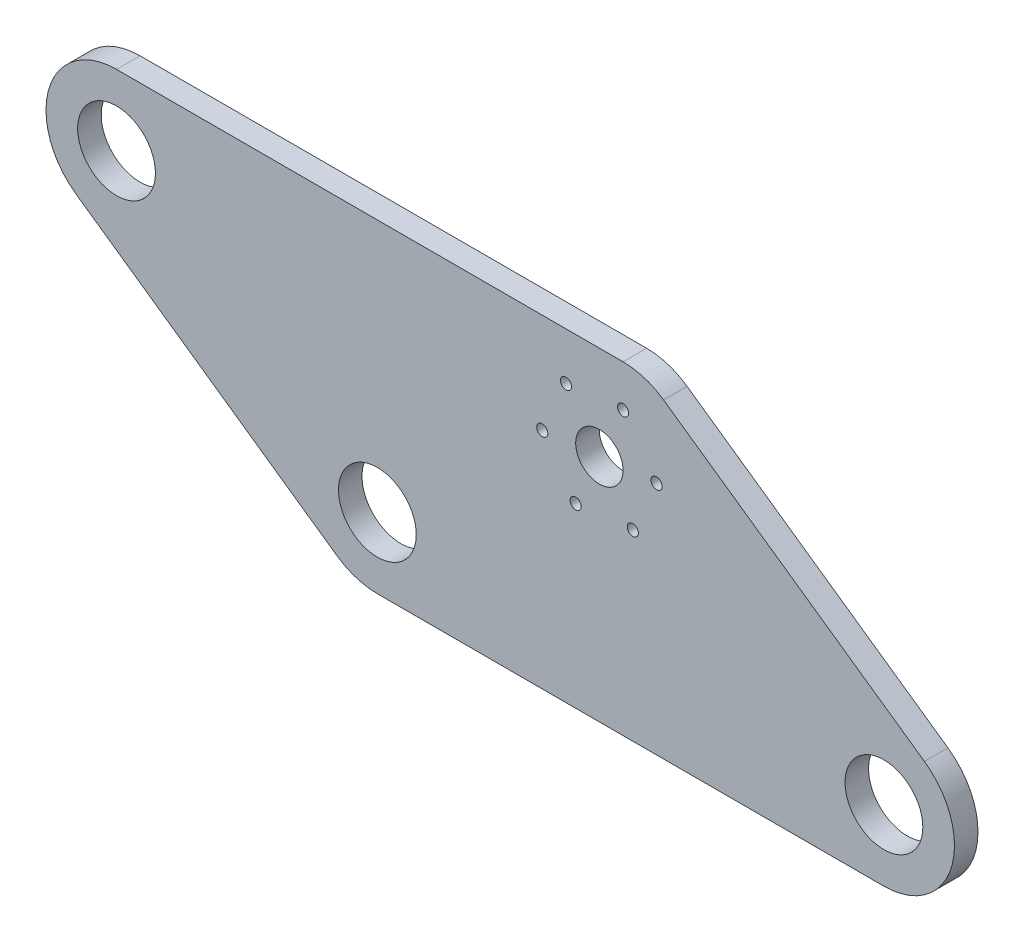
ISO-10303-21;
HEADER;
FILE_DESCRIPTION(('STEP AP214'),'2;1');
FILE_NAME('part.step','',(''),(''),'','','');
FILE_SCHEMA(('AUTOMOTIVE_DESIGN { 1 0 10303 214 1 1 1 1 }'));
ENDSEC;
DATA;
#1=APPLICATION_CONTEXT('core data for automotive mechanical design processes');
#2=APPLICATION_PROTOCOL_DEFINITION('international standard','automotive_design',2000,#1);
#3=PRODUCT_CONTEXT('',#1,'mechanical');
#4=PRODUCT('Part','Part','',(#3));
#5=PRODUCT_RELATED_PRODUCT_CATEGORY('part','',(#4));
#6=PRODUCT_DEFINITION_FORMATION('','',#4);
#7=PRODUCT_DEFINITION_CONTEXT('part definition',#1,'design');
#8=PRODUCT_DEFINITION('design','',#6,#7);
#9=PRODUCT_DEFINITION_SHAPE('','',#8);
#10=(LENGTH_UNIT() NAMED_UNIT(*) SI_UNIT(.MILLI.,.METRE.));
#11=(NAMED_UNIT(*) PLANE_ANGLE_UNIT() SI_UNIT($,.RADIAN.));
#12=(NAMED_UNIT(*) SI_UNIT($,.STERADIAN.) SOLID_ANGLE_UNIT());
#13=UNCERTAINTY_MEASURE_WITH_UNIT(LENGTH_MEASURE(1.E-05),#10,'distance_accuracy_value','');
#14=(GEOMETRIC_REPRESENTATION_CONTEXT(3) GLOBAL_UNCERTAINTY_ASSIGNED_CONTEXT((#13)) GLOBAL_UNIT_ASSIGNED_CONTEXT((#10,
#11,#12)) REPRESENTATION_CONTEXT('',''));
#15=CARTESIAN_POINT('',(0.,0.,0.));
#16=DIRECTION('',(0.,0.,1.));
#17=DIRECTION('',(1.,0.,0.));
#18=AXIS2_PLACEMENT_3D('',#15,#16,#17);
#19=CARTESIAN_POINT('',(-27.5612284503571,-62.0130488998987,6.35));
#20=DIRECTION('',(0.573576436351041,0.819152044288995,0.));
#21=DIRECTION('',(-0.819152044288995,0.573576436351041,0.));
#22=AXIS2_PLACEMENT_3D('',#19,#20,#21);
#23=PLANE('',#22);
#24=DIRECTION('',(0.819152044288995,-0.573576436351041,0.));
#25=VECTOR('',#24,1.);
#26=CARTESIAN_POINT('',(-27.5612284503571,-62.0130488998987,0.));
#27=LINE('',#26,#25);
#28=CARTESIAN_POINT('',(-102.907750127468,-9.25484644370535,0.));
#29=VERTEX_POINT('',#28);
#30=CARTESIAN_POINT('',(-32.4814176346999,-58.5678953436041,0.));
#31=VERTEX_POINT('',#30);
#32=EDGE_CURVE('E165',#29,#31,#27,.T.);
#33=ORIENTED_EDGE('',*,*,#32,.T.);
#34=DIRECTION('',(0.,0.,-1.));
#35=VECTOR('',#34,1.);
#36=CARTESIAN_POINT('',(-32.4814176346999,-58.5678953436041,6.35));
#37=LINE('',#36,#35);
#38=CARTESIAN_POINT('',(-32.4814176346999,-58.5678953436041,6.35));
#39=VERTEX_POINT('',#38);
#40=EDGE_CURVE('E11',#31,#39,#37,.F.);
#41=ORIENTED_EDGE('',*,*,#40,.T.);
#42=DIRECTION('',(0.819152044288995,-0.573576436351041,0.));
#43=VECTOR('',#42,1.);
#44=CARTESIAN_POINT('',(-27.5612284503571,-62.0130488998987,6.35));
#45=LINE('',#44,#43);
#46=CARTESIAN_POINT('',(-102.907750127468,-9.25484644370535,6.35));
#47=VERTEX_POINT('',#46);
#48=EDGE_CURVE('E133',#47,#39,#45,.T.);
#49=ORIENTED_EDGE('',*,*,#48,.F.);
#50=DIRECTION('',(0.,0.,-1.));
#51=VECTOR('',#50,1.);
#52=CARTESIAN_POINT('',(-102.907750127468,-9.25484644370535,6.35));
#53=LINE('',#52,#51);
#54=EDGE_CURVE('E49',#47,#29,#53,.T.);
#55=ORIENTED_EDGE('',*,*,#54,.T.);
#56=EDGE_LOOP('',(#33,#41,#49,#55));
#57=FACE_BOUND('',#56,.T.);
#58=ADVANCED_FACE('F41',(#57),#23,.F.);
#59=CARTESIAN_POINT('',(175.638771549643,-62.0130488998987,6.35));
#60=DIRECTION('',(0.,1.,0.));
#61=DIRECTION('',(-1.,0.,0.));
#62=AXIS2_PLACEMENT_3D('',#59,#60,#61);
#63=PLANE('',#62);
#64=DIRECTION('',(1.,0.,0.));
#65=VECTOR('',#64,1.);
#66=CARTESIAN_POINT('',(175.638771549643,-62.0130488998987,6.35));
#67=LINE('',#66,#65);
#68=CARTESIAN_POINT('',(-21.5547865222126,-62.0130488998987,6.35));
#69=VERTEX_POINT('',#68);
#70=CARTESIAN_POINT('',(115.219890564623,-62.0130488998987,6.35));
#71=VERTEX_POINT('',#70);
#72=EDGE_CURVE('E136',#69,#71,#67,.T.);
#73=ORIENTED_EDGE('',*,*,#72,.F.);
#74=DIRECTION('',(0.,0.,-1.));
#75=VECTOR('',#74,1.);
#76=CARTESIAN_POINT('',(-21.5547865222126,-62.0130488998987,6.35));
#77=LINE('',#76,#75);
#78=CARTESIAN_POINT('',(-21.5547865222126,-62.0130488998987,0.));
#79=VERTEX_POINT('',#78);
#80=EDGE_CURVE('E158',#69,#79,#77,.T.);
#81=ORIENTED_EDGE('',*,*,#80,.T.);
#82=DIRECTION('',(1.,0.,0.));
#83=VECTOR('',#82,1.);
#84=CARTESIAN_POINT('',(175.638771549643,-62.0130488998987,0.));
#85=LINE('',#84,#83);
#86=CARTESIAN_POINT('',(115.219890564623,-62.0130488998987,0.));
#87=VERTEX_POINT('',#86);
#88=EDGE_CURVE('E138',#79,#87,#85,.T.);
#89=ORIENTED_EDGE('',*,*,#88,.T.);
#90=DIRECTION('',(0.,0.,-1.));
#91=VECTOR('',#90,1.);
#92=CARTESIAN_POINT('',(115.219890564623,-62.0130488998987,6.35));
#93=LINE('',#92,#91);
#94=EDGE_CURVE('E56',#87,#71,#93,.F.);
#95=ORIENTED_EDGE('',*,*,#94,.T.);
#96=EDGE_LOOP('',(#73,#81,#89,#95));
#97=FACE_BOUND('',#96,.T.);
#98=ADVANCED_FACE('F268',(#97),#63,.F.);
#99=CARTESIAN_POINT('',(50.8,25.4,6.35));
#100=DIRECTION('',(-0.573576436351041,-0.819152044288995,0.));
#101=DIRECTION('',(0.819152044288995,-0.573576436351041,0.));
#102=AXIS2_PLACEMENT_3D('',#99,#100,#101);
#103=PLANE('',#102);
#104=DIRECTION('',(-0.819152044288995,0.573576436351041,0.));
#105=VECTOR('',#104,1.);
#106=CARTESIAN_POINT('',(50.8,25.4,0.));
#107=LINE('',#106,#105);
#108=CARTESIAN_POINT('',(126.14652167711,-27.3582024561934,0.));
#109=VERTEX_POINT('',#108);
#110=CARTESIAN_POINT('',(55.7201891843428,21.9548464437054,0.));
#111=VERTEX_POINT('',#110);
#112=EDGE_CURVE('E134',#109,#111,#107,.T.);
#113=ORIENTED_EDGE('',*,*,#112,.T.);
#114=DIRECTION('',(0.,0.,-1.));
#115=VECTOR('',#114,1.);
#116=CARTESIAN_POINT('',(55.7201891843428,21.9548464437054,6.35));
#117=LINE('',#116,#115);
#118=CARTESIAN_POINT('',(55.7201891843428,21.9548464437054,6.35));
#119=VERTEX_POINT('',#118);
#120=EDGE_CURVE('E112',#111,#119,#117,.F.);
#121=ORIENTED_EDGE('',*,*,#120,.T.);
#122=DIRECTION('',(-0.819152044288995,0.573576436351041,0.));
#123=VECTOR('',#122,1.);
#124=CARTESIAN_POINT('',(50.8,25.4,6.35));
#125=LINE('',#124,#123);
#126=CARTESIAN_POINT('',(126.14652167711,-27.3582024561934,6.35));
#127=VERTEX_POINT('',#126);
#128=EDGE_CURVE('E177',#127,#119,#125,.T.);
#129=ORIENTED_EDGE('',*,*,#128,.F.);
#130=DIRECTION('',(0.,0.,-1.));
#131=VECTOR('',#130,1.);
#132=CARTESIAN_POINT('',(126.14652167711,-27.3582024561934,6.35));
#133=LINE('',#132,#131);
#134=EDGE_CURVE('E117',#127,#109,#133,.T.);
#135=ORIENTED_EDGE('',*,*,#134,.T.);
#136=EDGE_LOOP('',(#113,#121,#129,#135));
#137=FACE_BOUND('',#136,.T.);
#138=ADVANCED_FACE('F265',(#137),#103,.F.);
#139=CARTESIAN_POINT('',(-152.4,25.4,6.35));
#140=DIRECTION('',(0.,-1.,0.));
#141=DIRECTION('',(0.,0.,-1.));
#142=AXIS2_PLACEMENT_3D('',#139,#140,#141);
#143=PLANE('',#142);
#144=DIRECTION('',(-1.,0.,0.));
#145=VECTOR('',#144,1.);
#146=CARTESIAN_POINT('',(-152.4,25.4,6.35));
#147=LINE('',#146,#145);
#148=CARTESIAN_POINT('',(44.7935580718554,25.4,6.35));
#149=VERTEX_POINT('',#148);
#150=CARTESIAN_POINT('',(-91.9811190149802,25.4,6.35));
#151=VERTEX_POINT('',#150);
#152=EDGE_CURVE('E127',#149,#151,#147,.T.);
#153=ORIENTED_EDGE('',*,*,#152,.F.);
#154=DIRECTION('',(0.,0.,-1.));
#155=VECTOR('',#154,1.);
#156=CARTESIAN_POINT('',(44.7935580718554,25.4,6.35));
#157=LINE('',#156,#155);
#158=CARTESIAN_POINT('',(44.7935580718554,25.4,0.));
#159=VERTEX_POINT('',#158);
#160=EDGE_CURVE('E111',#149,#159,#157,.T.);
#161=ORIENTED_EDGE('',*,*,#160,.T.);
#162=DIRECTION('',(-1.,0.,0.));
#163=VECTOR('',#162,1.);
#164=CARTESIAN_POINT('',(-152.4,25.4,0.));
#165=LINE('',#164,#163);
#166=CARTESIAN_POINT('',(-91.9811190149802,25.4,0.));
#167=VERTEX_POINT('',#166);
#168=EDGE_CURVE('E124',#159,#167,#165,.T.);
#169=ORIENTED_EDGE('',*,*,#168,.T.);
#170=DIRECTION('',(0.,0.,-1.));
#171=VECTOR('',#170,1.);
#172=CARTESIAN_POINT('',(-91.9811190149802,25.4,6.35));
#173=LINE('',#172,#171);
#174=EDGE_CURVE('E129',#167,#151,#173,.F.);
#175=ORIENTED_EDGE('',*,*,#174,.T.);
#176=EDGE_LOOP('',(#153,#161,#169,#175));
#177=FACE_BOUND('',#176,.T.);
#178=ADVANCED_FACE('F123',(#177),#143,.F.);
#179=CARTESIAN_POINT('',(0.,0.,6.35));
#180=DIRECTION('',(0.,0.,-1.));
#181=DIRECTION('',(-1.,0.,0.));
#182=AXIS2_PLACEMENT_3D('',#179,#180,#181);
#183=PLANE('',#182);
#184=CARTESIAN_POINT('',(-91.9811190149802,6.35,6.35));
#185=DIRECTION('',(0.,0.,1.));
#186=DIRECTION('',(1.,0.,0.));
#187=AXIS2_PLACEMENT_3D('',#184,#185,#186);
#188=CIRCLE('',#187,10.5);
#189=CARTESIAN_POINT('',(-81.4811190149802,6.35,6.35));
#190=VERTEX_POINT('',#189);
#191=EDGE_CURVE('E173',#190,#190,#188,.T.);
#192=ORIENTED_EDGE('',*,*,#191,.F.);
#193=EDGE_LOOP('',(#192));
#194=FACE_BOUND('',#193,.T.);
#195=CARTESIAN_POINT('',(29.367867907288,12.6010680917624,6.35));
#196=DIRECTION('',(0.,0.,1.));
#197=DIRECTION('',(1.,0.,0.));
#198=AXIS2_PLACEMENT_3D('',#195,#196,#197);
#199=CIRCLE('',#198,1.50000000000001);
#200=CARTESIAN_POINT('',(30.867867907288,12.6010680917624,6.35));
#201=VERTEX_POINT('',#200);
#202=EDGE_CURVE('E210',#201,#201,#199,.T.);
#203=ORIENTED_EDGE('',*,*,#202,.F.);
#204=EDGE_LOOP('',(#203));
#205=FACE_BOUND('',#204,.T.);
#206=CARTESIAN_POINT('',(44.7935580718554,14.1170110150839,6.35));
#207=DIRECTION('',(0.,0.,1.));
#208=DIRECTION('',(1.,0.,0.));
#209=AXIS2_PLACEMENT_3D('',#206,#207,#208);
#210=CIRCLE('',#209,1.5);
#211=CARTESIAN_POINT('',(46.2935580718554,14.1170110150839,6.35));
#212=VERTEX_POINT('',#211);
#213=EDGE_CURVE('E197',#212,#212,#210,.T.);
#214=ORIENTED_EDGE('',*,*,#213,.F.);
#215=EDGE_LOOP('',(#214));
#216=FACE_BOUND('',#215,.T.);
#217=CARTESIAN_POINT('',(115.219890564623,-42.9630488998987,6.35));
#218=DIRECTION('',(0.,0.,1.));
#219=DIRECTION('',(1.,0.,0.));
#220=AXIS2_PLACEMENT_3D('',#217,#218,#219);
#221=CIRCLE('',#220,10.5);
#222=CARTESIAN_POINT('',(125.719890564623,-42.9630488998987,6.35));
#223=VERTEX_POINT('',#222);
#224=EDGE_CURVE('E185',#223,#223,#221,.T.);
#225=ORIENTED_EDGE('',*,*,#224,.F.);
#226=EDGE_LOOP('',(#225));
#227=FACE_BOUND('',#226,.T.);
#228=CARTESIAN_POINT('',(-21.5547865222126,-42.9630488998987,6.35));
#229=DIRECTION('',(0.,0.,1.));
#230=DIRECTION('',(1.,0.,0.));
#231=AXIS2_PLACEMENT_3D('',#228,#229,#230);
#232=CIRCLE('',#231,10.5);
#233=CARTESIAN_POINT('',(-11.0547865222126,-42.9630488998987,6.35));
#234=VERTEX_POINT('',#233);
#235=EDGE_CURVE('E184',#234,#234,#232,.T.);
#236=ORIENTED_EDGE('',*,*,#235,.F.);
#237=EDGE_LOOP('',(#236));
#238=FACE_BOUND('',#237,.T.);
#239=CARTESIAN_POINT('',(38.3935580718554,0.,6.35));
#240=DIRECTION('',(0.,0.,1.));
#241=DIRECTION('',(1.,0.,0.));
#242=AXIS2_PLACEMENT_3D('',#239,#240,#241);
#243=CIRCLE('',#242,6.40000000000001);
#244=CARTESIAN_POINT('',(44.7935580718554,0.,6.35));
#245=VERTEX_POINT('',#244);
#246=EDGE_CURVE('E191',#245,#245,#243,.T.);
#247=ORIENTED_EDGE('',*,*,#246,.F.);
#248=EDGE_LOOP('',(#247));
#249=FACE_BOUND('',#248,.T.);
#250=CARTESIAN_POINT('',(53.8192482364228,1.51594292332154,6.35));
#251=DIRECTION('',(0.,0.,1.));
#252=DIRECTION('',(1.,0.,0.));
#253=AXIS2_PLACEMENT_3D('',#250,#251,#252);
#254=CIRCLE('',#253,1.5);
#255=CARTESIAN_POINT('',(55.3192482364228,1.51594292332154,6.35));
#256=VERTEX_POINT('',#255);
#257=EDGE_CURVE('E198',#256,#256,#254,.T.);
#258=ORIENTED_EDGE('',*,*,#257,.F.);
#259=EDGE_LOOP('',(#258));
#260=FACE_BOUND('',#259,.T.);
#261=CARTESIAN_POINT('',(47.4192482364228,-12.6010680917623,6.35));
#262=DIRECTION('',(0.,0.,1.));
#263=DIRECTION('',(1.,0.,0.));
#264=AXIS2_PLACEMENT_3D('',#261,#262,#263);
#265=CIRCLE('',#264,1.50000000000001);
#266=CARTESIAN_POINT('',(48.9192482364228,-12.6010680917623,6.35));
#267=VERTEX_POINT('',#266);
#268=EDGE_CURVE('E222',#267,#267,#265,.T.);
#269=ORIENTED_EDGE('',*,*,#268,.F.);
#270=EDGE_LOOP('',(#269));
#271=FACE_BOUND('',#270,.T.);
#272=CARTESIAN_POINT('',(31.9935580718554,-14.1170110150839,6.35));
#273=DIRECTION('',(0.,0.,1.));
#274=DIRECTION('',(1.,0.,0.));
#275=AXIS2_PLACEMENT_3D('',#272,#273,#274);
#276=CIRCLE('',#275,1.5);
#277=CARTESIAN_POINT('',(33.4935580718554,-14.1170110150839,6.35));
#278=VERTEX_POINT('',#277);
#279=EDGE_CURVE('E216',#278,#278,#276,.T.);
#280=ORIENTED_EDGE('',*,*,#279,.F.);
#281=EDGE_LOOP('',(#280));
#282=FACE_BOUND('',#281,.T.);
#283=CARTESIAN_POINT('',(22.967867907288,-1.51594292332154,6.35));
#284=DIRECTION('',(0.,0.,1.));
#285=DIRECTION('',(1.,0.,0.));
#286=AXIS2_PLACEMENT_3D('',#283,#284,#285);
#287=CIRCLE('',#286,1.5);
#288=CARTESIAN_POINT('',(24.467867907288,-1.51594292332154,6.35));
#289=VERTEX_POINT('',#288);
#290=EDGE_CURVE('E209',#289,#289,#287,.T.);
#291=ORIENTED_EDGE('',*,*,#290,.F.);
#292=EDGE_LOOP('',(#291));
#293=FACE_BOUND('',#292,.T.);
#294=ORIENTED_EDGE('',*,*,#128,.T.);
#295=CARTESIAN_POINT('',(44.7935580718554,6.35,6.35));
#296=DIRECTION('',(0.,0.,-1.));
#297=DIRECTION('',(-1.,0.,0.));
#298=AXIS2_PLACEMENT_3D('',#295,#296,#297);
#299=CIRCLE('',#298,19.05);
#300=EDGE_CURVE('E155',#119,#149,#299,.F.);
#301=ORIENTED_EDGE('',*,*,#300,.T.);
#302=ORIENTED_EDGE('',*,*,#152,.T.);
#303=CARTESIAN_POINT('',(-91.9811190149802,6.35,6.35));
#304=DIRECTION('',(0.,0.,-1.));
#305=DIRECTION('',(-1.,0.,0.));
#306=AXIS2_PLACEMENT_3D('',#303,#304,#305);
#307=CIRCLE('',#306,19.05);
#308=EDGE_CURVE('E150',#151,#47,#307,.F.);
#309=ORIENTED_EDGE('',*,*,#308,.T.);
#310=ORIENTED_EDGE('',*,*,#48,.T.);
#311=CARTESIAN_POINT('',(-21.5547865222126,-42.9630488998987,6.35));
#312=DIRECTION('',(0.,0.,-1.));
#313=DIRECTION('',(-1.,0.,0.));
#314=AXIS2_PLACEMENT_3D('',#311,#312,#313);
#315=CIRCLE('',#314,19.05);
#316=EDGE_CURVE('E63',#39,#69,#315,.F.);
#317=ORIENTED_EDGE('',*,*,#316,.T.);
#318=ORIENTED_EDGE('',*,*,#72,.T.);
#319=CARTESIAN_POINT('',(115.219890564623,-42.9630488998987,6.35));
#320=DIRECTION('',(0.,0.,-1.));
#321=DIRECTION('',(-1.,0.,0.));
#322=AXIS2_PLACEMENT_3D('',#319,#320,#321);
#323=CIRCLE('',#322,19.05);
#324=EDGE_CURVE('E152',#71,#127,#323,.F.);
#325=ORIENTED_EDGE('',*,*,#324,.T.);
#326=EDGE_LOOP('',(#294,#301,#302,#309,#310,#317,#318,#325));
#327=FACE_BOUND('',#326,.T.);
#328=ADVANCED_FACE('F240',(#194,#205,#216,#227,#238,#249,#260,#271,#282,#293,#327),#183,.F.);
#329=CARTESIAN_POINT('',(0.,0.,0.));
#330=DIRECTION('',(0.,0.,-1.));
#331=DIRECTION('',(-1.,0.,0.));
#332=AXIS2_PLACEMENT_3D('',#329,#330,#331);
#333=PLANE('',#332);
#334=CARTESIAN_POINT('',(-91.9811190149802,6.35,0.));
#335=DIRECTION('',(0.,0.,1.));
#336=DIRECTION('',(1.,0.,0.));
#337=AXIS2_PLACEMENT_3D('',#334,#335,#336);
#338=CIRCLE('',#337,10.5);
#339=CARTESIAN_POINT('',(-81.4811190149802,6.35,0.));
#340=VERTEX_POINT('',#339);
#341=EDGE_CURVE('E170',#340,#340,#338,.T.);
#342=ORIENTED_EDGE('',*,*,#341,.T.);
#343=EDGE_LOOP('',(#342));
#344=FACE_BOUND('',#343,.T.);
#345=CARTESIAN_POINT('',(29.367867907288,12.6010680917624,0.));
#346=DIRECTION('',(0.,0.,1.));
#347=DIRECTION('',(1.,0.,0.));
#348=AXIS2_PLACEMENT_3D('',#345,#346,#347);
#349=CIRCLE('',#348,1.50000000000001);
#350=CARTESIAN_POINT('',(30.867867907288,12.6010680917624,0.));
#351=VERTEX_POINT('',#350);
#352=EDGE_CURVE('E230',#351,#351,#349,.T.);
#353=ORIENTED_EDGE('',*,*,#352,.T.);
#354=EDGE_LOOP('',(#353));
#355=FACE_BOUND('',#354,.T.);
#356=CARTESIAN_POINT('',(44.7935580718554,14.1170110150839,0.));
#357=DIRECTION('',(0.,0.,1.));
#358=DIRECTION('',(1.,0.,0.));
#359=AXIS2_PLACEMENT_3D('',#356,#357,#358);
#360=CIRCLE('',#359,1.5);
#361=CARTESIAN_POINT('',(46.2935580718554,14.1170110150839,0.));
#362=VERTEX_POINT('',#361);
#363=EDGE_CURVE('E194',#362,#362,#360,.T.);
#364=ORIENTED_EDGE('',*,*,#363,.T.);
#365=EDGE_LOOP('',(#364));
#366=FACE_BOUND('',#365,.T.);
#367=CARTESIAN_POINT('',(115.219890564623,-42.9630488998987,0.));
#368=DIRECTION('',(0.,0.,1.));
#369=DIRECTION('',(1.,0.,0.));
#370=AXIS2_PLACEMENT_3D('',#367,#368,#369);
#371=CIRCLE('',#370,10.5);
#372=CARTESIAN_POINT('',(125.719890564623,-42.9630488998987,0.));
#373=VERTEX_POINT('',#372);
#374=EDGE_CURVE('E201',#373,#373,#371,.T.);
#375=ORIENTED_EDGE('',*,*,#374,.T.);
#376=EDGE_LOOP('',(#375));
#377=FACE_BOUND('',#376,.T.);
#378=CARTESIAN_POINT('',(-21.5547865222126,-42.9630488998987,0.));
#379=DIRECTION('',(0.,0.,1.));
#380=DIRECTION('',(1.,0.,0.));
#381=AXIS2_PLACEMENT_3D('',#378,#379,#380);
#382=CIRCLE('',#381,10.5);
#383=CARTESIAN_POINT('',(-11.0547865222126,-42.9630488998987,0.));
#384=VERTEX_POINT('',#383);
#385=EDGE_CURVE('E181',#384,#384,#382,.T.);
#386=ORIENTED_EDGE('',*,*,#385,.T.);
#387=EDGE_LOOP('',(#386));
#388=FACE_BOUND('',#387,.T.);
#389=CARTESIAN_POINT('',(38.3935580718554,0.,0.));
#390=DIRECTION('',(0.,0.,1.));
#391=DIRECTION('',(1.,0.,0.));
#392=AXIS2_PLACEMENT_3D('',#389,#390,#391);
#393=CIRCLE('',#392,6.40000000000001);
#394=CARTESIAN_POINT('',(44.7935580718554,0.,0.));
#395=VERTEX_POINT('',#394);
#396=EDGE_CURVE('E188',#395,#395,#393,.T.);
#397=ORIENTED_EDGE('',*,*,#396,.T.);
#398=EDGE_LOOP('',(#397));
#399=FACE_BOUND('',#398,.T.);
#400=CARTESIAN_POINT('',(53.8192482364228,1.51594292332154,0.));
#401=DIRECTION('',(0.,0.,1.));
#402=DIRECTION('',(1.,0.,0.));
#403=AXIS2_PLACEMENT_3D('',#400,#401,#402);
#404=CIRCLE('',#403,1.5);
#405=CARTESIAN_POINT('',(55.3192482364228,1.51594292332154,0.));
#406=VERTEX_POINT('',#405);
#407=EDGE_CURVE('E225',#406,#406,#404,.T.);
#408=ORIENTED_EDGE('',*,*,#407,.T.);
#409=EDGE_LOOP('',(#408));
#410=FACE_BOUND('',#409,.T.);
#411=CARTESIAN_POINT('',(47.4192482364228,-12.6010680917623,0.));
#412=DIRECTION('',(0.,0.,1.));
#413=DIRECTION('',(1.,0.,0.));
#414=AXIS2_PLACEMENT_3D('',#411,#412,#413);
#415=CIRCLE('',#414,1.50000000000001);
#416=CARTESIAN_POINT('',(48.9192482364228,-12.6010680917623,0.));
#417=VERTEX_POINT('',#416);
#418=EDGE_CURVE('E219',#417,#417,#415,.T.);
#419=ORIENTED_EDGE('',*,*,#418,.T.);
#420=EDGE_LOOP('',(#419));
#421=FACE_BOUND('',#420,.T.);
#422=CARTESIAN_POINT('',(31.9935580718554,-14.1170110150839,0.));
#423=DIRECTION('',(0.,0.,1.));
#424=DIRECTION('',(1.,0.,0.));
#425=AXIS2_PLACEMENT_3D('',#422,#423,#424);
#426=CIRCLE('',#425,1.5);
#427=CARTESIAN_POINT('',(33.4935580718554,-14.1170110150839,0.));
#428=VERTEX_POINT('',#427);
#429=EDGE_CURVE('E213',#428,#428,#426,.T.);
#430=ORIENTED_EDGE('',*,*,#429,.T.);
#431=EDGE_LOOP('',(#430));
#432=FACE_BOUND('',#431,.T.);
#433=CARTESIAN_POINT('',(22.967867907288,-1.51594292332154,0.));
#434=DIRECTION('',(0.,0.,1.));
#435=DIRECTION('',(1.,0.,0.));
#436=AXIS2_PLACEMENT_3D('',#433,#434,#435);
#437=CIRCLE('',#436,1.5);
#438=CARTESIAN_POINT('',(24.467867907288,-1.51594292332154,0.));
#439=VERTEX_POINT('',#438);
#440=EDGE_CURVE('E206',#439,#439,#437,.T.);
#441=ORIENTED_EDGE('',*,*,#440,.T.);
#442=EDGE_LOOP('',(#441));
#443=FACE_BOUND('',#442,.T.);
#444=ORIENTED_EDGE('',*,*,#168,.F.);
#445=CARTESIAN_POINT('',(44.7935580718554,6.35,0.));
#446=DIRECTION('',(0.,0.,-1.));
#447=DIRECTION('',(-1.,0.,0.));
#448=AXIS2_PLACEMENT_3D('',#445,#446,#447);
#449=CIRCLE('',#448,19.05);
#450=EDGE_CURVE('E107',#159,#111,#449,.T.);
#451=ORIENTED_EDGE('',*,*,#450,.T.);
#452=ORIENTED_EDGE('',*,*,#112,.F.);
#453=CARTESIAN_POINT('',(115.219890564623,-42.9630488998987,0.));
#454=DIRECTION('',(0.,0.,-1.));
#455=DIRECTION('',(-1.,0.,0.));
#456=AXIS2_PLACEMENT_3D('',#453,#454,#455);
#457=CIRCLE('',#456,19.05);
#458=EDGE_CURVE('E144',#109,#87,#457,.T.);
#459=ORIENTED_EDGE('',*,*,#458,.T.);
#460=ORIENTED_EDGE('',*,*,#88,.F.);
#461=CARTESIAN_POINT('',(-21.5547865222126,-42.9630488998987,0.));
#462=DIRECTION('',(0.,0.,-1.));
#463=DIRECTION('',(-1.,0.,0.));
#464=AXIS2_PLACEMENT_3D('',#461,#462,#463);
#465=CIRCLE('',#464,19.05);
#466=EDGE_CURVE('E118',#79,#31,#465,.T.);
#467=ORIENTED_EDGE('',*,*,#466,.T.);
#468=ORIENTED_EDGE('',*,*,#32,.F.);
#469=CARTESIAN_POINT('',(-91.9811190149802,6.35,0.));
#470=DIRECTION('',(0.,0.,-1.));
#471=DIRECTION('',(-1.,0.,0.));
#472=AXIS2_PLACEMENT_3D('',#469,#470,#471);
#473=CIRCLE('',#472,19.05);
#474=EDGE_CURVE('E128',#29,#167,#473,.T.);
#475=ORIENTED_EDGE('',*,*,#474,.T.);
#476=EDGE_LOOP('',(#444,#451,#452,#459,#460,#467,#468,#475));
#477=FACE_BOUND('',#476,.T.);
#478=ADVANCED_FACE('F131',(#344,#355,#366,#377,#388,#399,#410,#421,#432,#443,#477),#333,.T.);
#479=CARTESIAN_POINT('',(44.7935580718554,6.35,6.35));
#480=DIRECTION('',(0.,0.,-1.));
#481=DIRECTION('',(-1.,0.,0.));
#482=AXIS2_PLACEMENT_3D('',#479,#480,#481);
#483=CYLINDRICAL_SURFACE('',#482,19.05);
#484=ORIENTED_EDGE('',*,*,#300,.F.);
#485=ORIENTED_EDGE('',*,*,#120,.F.);
#486=ORIENTED_EDGE('',*,*,#450,.F.);
#487=ORIENTED_EDGE('',*,*,#160,.F.);
#488=EDGE_LOOP('',(#484,#485,#486,#487));
#489=FACE_BOUND('',#488,.T.);
#490=ADVANCED_FACE('F110',(#489),#483,.T.);
#491=CARTESIAN_POINT('',(-21.5547865222126,-42.9630488998987,6.35));
#492=DIRECTION('',(0.,0.,-1.));
#493=DIRECTION('',(-1.,0.,0.));
#494=AXIS2_PLACEMENT_3D('',#491,#492,#493);
#495=CYLINDRICAL_SURFACE('',#494,19.05);
#496=ORIENTED_EDGE('',*,*,#316,.F.);
#497=ORIENTED_EDGE('',*,*,#40,.F.);
#498=ORIENTED_EDGE('',*,*,#466,.F.);
#499=ORIENTED_EDGE('',*,*,#80,.F.);
#500=EDGE_LOOP('',(#496,#497,#498,#499));
#501=FACE_BOUND('',#500,.T.);
#502=ADVANCED_FACE('F271',(#501),#495,.T.);
#503=CARTESIAN_POINT('',(115.219890564623,-42.9630488998987,6.35));
#504=DIRECTION('',(0.,0.,-1.));
#505=DIRECTION('',(-1.,0.,0.));
#506=AXIS2_PLACEMENT_3D('',#503,#504,#505);
#507=CYLINDRICAL_SURFACE('',#506,19.05);
#508=ORIENTED_EDGE('',*,*,#324,.F.);
#509=ORIENTED_EDGE('',*,*,#94,.F.);
#510=ORIENTED_EDGE('',*,*,#458,.F.);
#511=ORIENTED_EDGE('',*,*,#134,.F.);
#512=EDGE_LOOP('',(#508,#509,#510,#511));
#513=FACE_BOUND('',#512,.T.);
#514=ADVANCED_FACE('F267',(#513),#507,.T.);
#515=CARTESIAN_POINT('',(-91.9811190149802,6.35,6.35));
#516=DIRECTION('',(0.,0.,-1.));
#517=DIRECTION('',(-1.,0.,0.));
#518=AXIS2_PLACEMENT_3D('',#515,#516,#517);
#519=CYLINDRICAL_SURFACE('',#518,19.05);
#520=ORIENTED_EDGE('',*,*,#308,.F.);
#521=ORIENTED_EDGE('',*,*,#174,.F.);
#522=ORIENTED_EDGE('',*,*,#474,.F.);
#523=ORIENTED_EDGE('',*,*,#54,.F.);
#524=EDGE_LOOP('',(#520,#521,#522,#523));
#525=FACE_BOUND('',#524,.T.);
#526=ADVANCED_FACE('F43',(#525),#519,.T.);
#527=CARTESIAN_POINT('',(22.967867907288,-1.51594292332154,0.));
#528=DIRECTION('',(0.,0.,1.));
#529=DIRECTION('',(1.,0.,0.));
#530=AXIS2_PLACEMENT_3D('',#527,#528,#529);
#531=CYLINDRICAL_SURFACE('',#530,1.5);
#532=ORIENTED_EDGE('',*,*,#440,.F.);
#533=EDGE_LOOP('',(#532));
#534=FACE_BOUND('',#533,.T.);
#535=ORIENTED_EDGE('',*,*,#290,.T.);
#536=EDGE_LOOP('',(#535));
#537=FACE_BOUND('',#536,.T.);
#538=ADVANCED_FACE('F273',(#534,#537),#531,.F.);
#539=CARTESIAN_POINT('',(31.9935580718554,-14.1170110150839,0.));
#540=DIRECTION('',(0.,0.,1.));
#541=DIRECTION('',(1.,0.,0.));
#542=AXIS2_PLACEMENT_3D('',#539,#540,#541);
#543=CYLINDRICAL_SURFACE('',#542,1.5);
#544=ORIENTED_EDGE('',*,*,#429,.F.);
#545=EDGE_LOOP('',(#544));
#546=FACE_BOUND('',#545,.T.);
#547=ORIENTED_EDGE('',*,*,#279,.T.);
#548=EDGE_LOOP('',(#547));
#549=FACE_BOUND('',#548,.T.);
#550=ADVANCED_FACE('F278',(#546,#549),#543,.F.);
#551=CARTESIAN_POINT('',(47.4192482364228,-12.6010680917623,0.));
#552=DIRECTION('',(0.,0.,1.));
#553=DIRECTION('',(1.,0.,0.));
#554=AXIS2_PLACEMENT_3D('',#551,#552,#553);
#555=CYLINDRICAL_SURFACE('',#554,1.50000000000001);
#556=ORIENTED_EDGE('',*,*,#418,.F.);
#557=EDGE_LOOP('',(#556));
#558=FACE_BOUND('',#557,.T.);
#559=ORIENTED_EDGE('',*,*,#268,.T.);
#560=EDGE_LOOP('',(#559));
#561=FACE_BOUND('',#560,.T.);
#562=ADVANCED_FACE('F323',(#558,#561),#555,.F.);
#563=CARTESIAN_POINT('',(53.8192482364228,1.51594292332154,0.));
#564=DIRECTION('',(0.,0.,1.));
#565=DIRECTION('',(1.,0.,0.));
#566=AXIS2_PLACEMENT_3D('',#563,#564,#565);
#567=CYLINDRICAL_SURFACE('',#566,1.5);
#568=ORIENTED_EDGE('',*,*,#407,.F.);
#569=EDGE_LOOP('',(#568));
#570=FACE_BOUND('',#569,.T.);
#571=ORIENTED_EDGE('',*,*,#257,.T.);
#572=EDGE_LOOP('',(#571));
#573=FACE_BOUND('',#572,.T.);
#574=ADVANCED_FACE('F333',(#570,#573),#567,.F.);
#575=CARTESIAN_POINT('',(38.3935580718554,0.,0.));
#576=DIRECTION('',(0.,0.,1.));
#577=DIRECTION('',(1.,0.,0.));
#578=AXIS2_PLACEMENT_3D('',#575,#576,#577);
#579=CYLINDRICAL_SURFACE('',#578,6.40000000000001);
#580=ORIENTED_EDGE('',*,*,#396,.F.);
#581=EDGE_LOOP('',(#580));
#582=FACE_BOUND('',#581,.T.);
#583=ORIENTED_EDGE('',*,*,#246,.T.);
#584=EDGE_LOOP('',(#583));
#585=FACE_BOUND('',#584,.T.);
#586=ADVANCED_FACE('F343',(#582,#585),#579,.F.);
#587=CARTESIAN_POINT('',(-21.5547865222126,-42.9630488998987,0.));
#588=DIRECTION('',(0.,0.,1.));
#589=DIRECTION('',(1.,0.,0.));
#590=AXIS2_PLACEMENT_3D('',#587,#588,#589);
#591=CYLINDRICAL_SURFACE('',#590,10.5);
#592=ORIENTED_EDGE('',*,*,#385,.F.);
#593=EDGE_LOOP('',(#592));
#594=FACE_BOUND('',#593,.T.);
#595=ORIENTED_EDGE('',*,*,#235,.T.);
#596=EDGE_LOOP('',(#595));
#597=FACE_BOUND('',#596,.T.);
#598=ADVANCED_FACE('F353',(#594,#597),#591,.F.);
#599=CARTESIAN_POINT('',(115.219890564623,-42.9630488998987,0.));
#600=DIRECTION('',(0.,0.,1.));
#601=DIRECTION('',(1.,0.,0.));
#602=AXIS2_PLACEMENT_3D('',#599,#600,#601);
#603=CYLINDRICAL_SURFACE('',#602,10.5);
#604=ORIENTED_EDGE('',*,*,#374,.F.);
#605=EDGE_LOOP('',(#604));
#606=FACE_BOUND('',#605,.T.);
#607=ORIENTED_EDGE('',*,*,#224,.T.);
#608=EDGE_LOOP('',(#607));
#609=FACE_BOUND('',#608,.T.);
#610=ADVANCED_FACE('F363',(#606,#609),#603,.F.);
#611=CARTESIAN_POINT('',(44.7935580718554,14.1170110150839,0.));
#612=DIRECTION('',(0.,0.,1.));
#613=DIRECTION('',(1.,0.,0.));
#614=AXIS2_PLACEMENT_3D('',#611,#612,#613);
#615=CYLINDRICAL_SURFACE('',#614,1.5);
#616=ORIENTED_EDGE('',*,*,#363,.F.);
#617=EDGE_LOOP('',(#616));
#618=FACE_BOUND('',#617,.T.);
#619=ORIENTED_EDGE('',*,*,#213,.T.);
#620=EDGE_LOOP('',(#619));
#621=FACE_BOUND('',#620,.T.);
#622=ADVANCED_FACE('F373',(#618,#621),#615,.F.);
#623=CARTESIAN_POINT('',(29.367867907288,12.6010680917624,0.));
#624=DIRECTION('',(0.,0.,1.));
#625=DIRECTION('',(1.,0.,0.));
#626=AXIS2_PLACEMENT_3D('',#623,#624,#625);
#627=CYLINDRICAL_SURFACE('',#626,1.50000000000001);
#628=ORIENTED_EDGE('',*,*,#352,.F.);
#629=EDGE_LOOP('',(#628));
#630=FACE_BOUND('',#629,.T.);
#631=ORIENTED_EDGE('',*,*,#202,.T.);
#632=EDGE_LOOP('',(#631));
#633=FACE_BOUND('',#632,.T.);
#634=ADVANCED_FACE('F383',(#630,#633),#627,.F.);
#635=CARTESIAN_POINT('',(-91.9811190149802,6.35,0.));
#636=DIRECTION('',(0.,0.,1.));
#637=DIRECTION('',(1.,0.,0.));
#638=AXIS2_PLACEMENT_3D('',#635,#636,#637);
#639=CYLINDRICAL_SURFACE('',#638,10.5);
#640=ORIENTED_EDGE('',*,*,#341,.F.);
#641=EDGE_LOOP('',(#640));
#642=FACE_BOUND('',#641,.T.);
#643=ORIENTED_EDGE('',*,*,#191,.T.);
#644=EDGE_LOOP('',(#643));
#645=FACE_BOUND('',#644,.T.);
#646=ADVANCED_FACE('F238',(#642,#645),#639,.F.);
#647=CLOSED_SHELL('',(#58,#98,#138,#178,#328,#478,#490,#502,#514,#526,#538,#550,#562,#574,#586,
#598,#610,#622,#634,#646));
#648=MANIFOLD_SOLID_BREP('B2',#647);
#649=ADVANCED_BREP_SHAPE_REPRESENTATION('',(#18,#648),#14);
#650=SHAPE_DEFINITION_REPRESENTATION(#9,#649);
ENDSEC;
END-ISO-10303-21;
